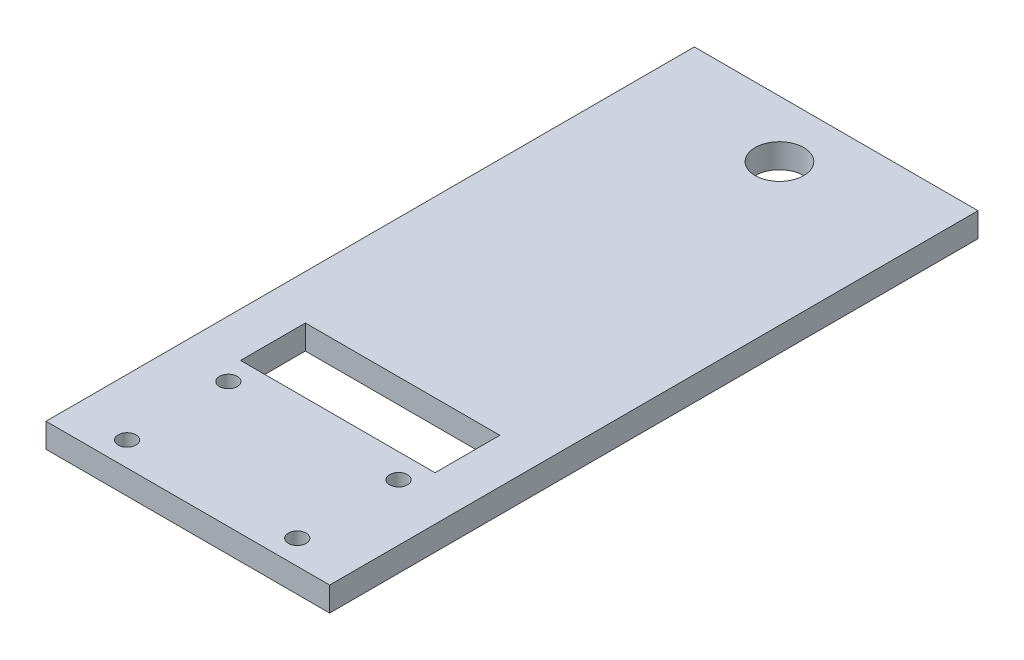
ISO-10303-21;
HEADER;
FILE_DESCRIPTION(('STEP AP214'),'2;1');
FILE_NAME('part.step','',(''),(''),'','','');
FILE_SCHEMA(('AUTOMOTIVE_DESIGN { 1 0 10303 214 1 1 1 1 }'));
ENDSEC;
DATA;
#1=APPLICATION_CONTEXT('core data for automotive mechanical design processes');
#2=APPLICATION_PROTOCOL_DEFINITION('international standard','automotive_design',2000,#1);
#3=PRODUCT_CONTEXT('',#1,'mechanical');
#4=PRODUCT('Part','Part','',(#3));
#5=PRODUCT_RELATED_PRODUCT_CATEGORY('part','',(#4));
#6=PRODUCT_DEFINITION_FORMATION('','',#4);
#7=PRODUCT_DEFINITION_CONTEXT('part definition',#1,'design');
#8=PRODUCT_DEFINITION('design','',#6,#7);
#9=PRODUCT_DEFINITION_SHAPE('','',#8);
#10=(LENGTH_UNIT() NAMED_UNIT(*) SI_UNIT(.MILLI.,.METRE.));
#11=(NAMED_UNIT(*) PLANE_ANGLE_UNIT() SI_UNIT($,.RADIAN.));
#12=(NAMED_UNIT(*) SI_UNIT($,.STERADIAN.) SOLID_ANGLE_UNIT());
#13=UNCERTAINTY_MEASURE_WITH_UNIT(LENGTH_MEASURE(1.E-05),#10,'distance_accuracy_value','');
#14=(GEOMETRIC_REPRESENTATION_CONTEXT(3) GLOBAL_UNCERTAINTY_ASSIGNED_CONTEXT((#13)) GLOBAL_UNIT_ASSIGNED_CONTEXT((#10,
#11,#12)) REPRESENTATION_CONTEXT('',''));
#15=CARTESIAN_POINT('',(0.,0.,0.));
#16=DIRECTION('',(0.,0.,1.));
#17=DIRECTION('',(1.,0.,0.));
#18=AXIS2_PLACEMENT_3D('',#15,#16,#17);
#19=CARTESIAN_POINT('',(0.,3.,0.));
#20=DIRECTION('',(0.,-1.,0.));
#21=DIRECTION('',(0.,0.,-1.));
#22=AXIS2_PLACEMENT_3D('',#19,#20,#21);
#23=PLANE('',#22);
#24=DIRECTION('',(-1.,0.,0.));
#25=VECTOR('',#24,1.);
#26=CARTESIAN_POINT('',(29.5,3.,-26.5));
#27=LINE('',#26,#25);
#28=CARTESIAN_POINT('',(29.5,3.,-26.5));
#29=VERTEX_POINT('',#28);
#30=CARTESIAN_POINT('',(5.5,3.,-26.5));
#31=VERTEX_POINT('',#30);
#32=EDGE_CURVE('E143',#29,#31,#27,.T.);
#33=ORIENTED_EDGE('',*,*,#32,.F.);
#34=DIRECTION('',(0.,0.,-1.));
#35=VECTOR('',#34,1.);
#36=CARTESIAN_POINT('',(29.5,3.,-18.5));
#37=LINE('',#36,#35);
#38=CARTESIAN_POINT('',(29.5,3.,-18.5));
#39=VERTEX_POINT('',#38);
#40=EDGE_CURVE('E59',#39,#29,#37,.T.);
#41=ORIENTED_EDGE('',*,*,#40,.F.);
#42=DIRECTION('',(1.,0.,0.));
#43=VECTOR('',#42,1.);
#44=CARTESIAN_POINT('',(29.5,3.,-18.5));
#45=LINE('',#44,#43);
#46=CARTESIAN_POINT('',(5.5,3.,-18.5));
#47=VERTEX_POINT('',#46);
#48=EDGE_CURVE('E130',#47,#39,#45,.T.);
#49=ORIENTED_EDGE('',*,*,#48,.F.);
#50=DIRECTION('',(0.,0.,1.));
#51=VECTOR('',#50,1.);
#52=CARTESIAN_POINT('',(5.5,3.,-18.5));
#53=LINE('',#52,#51);
#54=EDGE_CURVE('E134',#31,#47,#53,.T.);
#55=ORIENTED_EDGE('',*,*,#54,.F.);
#56=EDGE_LOOP('',(#33,#41,#49,#55));
#57=FACE_BOUND('',#56,.T.);
#58=CARTESIAN_POINT('',(17.5,3.,-73.));
#59=DIRECTION('',(0.,-1.,0.));
#60=DIRECTION('',(0.,0.,-1.));
#61=AXIS2_PLACEMENT_3D('',#58,#59,#60);
#62=CIRCLE('',#61,2.99999999999999);
#63=CARTESIAN_POINT('',(17.5,3.,-76.));
#64=VERTEX_POINT('',#63);
#65=EDGE_CURVE('E158',#64,#64,#62,.T.);
#66=ORIENTED_EDGE('',*,*,#65,.T.);
#67=EDGE_LOOP('',(#66));
#68=FACE_BOUND('',#67,.T.);
#69=DIRECTION('',(0.,0.,1.));
#70=VECTOR('',#69,1.);
#71=CARTESIAN_POINT('',(0.,3.,0.));
#72=LINE('',#71,#70);
#73=CARTESIAN_POINT('',(0.,3.,-80.));
#74=VERTEX_POINT('',#73);
#75=CARTESIAN_POINT('',(0.,3.,0.));
#76=VERTEX_POINT('',#75);
#77=EDGE_CURVE('E198',#74,#76,#72,.T.);
#78=ORIENTED_EDGE('',*,*,#77,.T.);
#79=DIRECTION('',(1.,0.,0.));
#80=VECTOR('',#79,1.);
#81=CARTESIAN_POINT('',(0.,3.,0.));
#82=LINE('',#81,#80);
#83=CARTESIAN_POINT('',(35.,3.,0.));
#84=VERTEX_POINT('',#83);
#85=EDGE_CURVE('E202',#76,#84,#82,.T.);
#86=ORIENTED_EDGE('',*,*,#85,.T.);
#87=DIRECTION('',(0.,0.,-1.));
#88=VECTOR('',#87,1.);
#89=CARTESIAN_POINT('',(35.,3.,0.));
#90=LINE('',#89,#88);
#91=CARTESIAN_POINT('',(35.,3.,-80.));
#92=VERTEX_POINT('',#91);
#93=EDGE_CURVE('E206',#84,#92,#90,.T.);
#94=ORIENTED_EDGE('',*,*,#93,.T.);
#95=DIRECTION('',(-1.,0.,0.));
#96=VECTOR('',#95,1.);
#97=CARTESIAN_POINT('',(0.,3.,-80.));
#98=LINE('',#97,#96);
#99=EDGE_CURVE('E209',#92,#74,#98,.T.);
#100=ORIENTED_EDGE('',*,*,#99,.T.);
#101=EDGE_LOOP('',(#78,#86,#94,#100));
#102=FACE_BOUND('',#101,.T.);
#103=CARTESIAN_POINT('',(7.,3.,-3.));
#104=DIRECTION('',(0.,1.,0.));
#105=DIRECTION('',(0.,0.,1.));
#106=AXIS2_PLACEMENT_3D('',#103,#104,#105);
#107=CIRCLE('',#106,1.1);
#108=CARTESIAN_POINT('',(7.,3.,-1.9));
#109=VERTEX_POINT('',#108);
#110=EDGE_CURVE('E190',#109,#109,#107,.T.);
#111=ORIENTED_EDGE('',*,*,#110,.F.);
#112=EDGE_LOOP('',(#111));
#113=FACE_BOUND('',#112,.T.);
#114=CARTESIAN_POINT('',(28.,3.,-3.));
#115=DIRECTION('',(0.,1.,0.));
#116=DIRECTION('',(0.,0.,1.));
#117=AXIS2_PLACEMENT_3D('',#114,#115,#116);
#118=CIRCLE('',#117,1.1);
#119=CARTESIAN_POINT('',(28.,3.,-1.9));
#120=VERTEX_POINT('',#119);
#121=EDGE_CURVE('E182',#120,#120,#118,.T.);
#122=ORIENTED_EDGE('',*,*,#121,.F.);
#123=EDGE_LOOP('',(#122));
#124=FACE_BOUND('',#123,.T.);
#125=CARTESIAN_POINT('',(7.,3.,-15.5));
#126=DIRECTION('',(0.,1.,0.));
#127=DIRECTION('',(0.,0.,1.));
#128=AXIS2_PLACEMENT_3D('',#125,#126,#127);
#129=CIRCLE('',#128,1.1);
#130=CARTESIAN_POINT('',(7.,3.,-14.4));
#131=VERTEX_POINT('',#130);
#132=EDGE_CURVE('E174',#131,#131,#129,.T.);
#133=ORIENTED_EDGE('',*,*,#132,.F.);
#134=EDGE_LOOP('',(#133));
#135=FACE_BOUND('',#134,.T.);
#136=CARTESIAN_POINT('',(28.,3.,-15.5));
#137=DIRECTION('',(0.,1.,0.));
#138=DIRECTION('',(0.,0.,1.));
#139=AXIS2_PLACEMENT_3D('',#136,#137,#138);
#140=CIRCLE('',#139,1.1);
#141=CARTESIAN_POINT('',(28.,3.,-14.4));
#142=VERTEX_POINT('',#141);
#143=EDGE_CURVE('E166',#142,#142,#140,.T.);
#144=ORIENTED_EDGE('',*,*,#143,.F.);
#145=EDGE_LOOP('',(#144));
#146=FACE_BOUND('',#145,.T.);
#147=ADVANCED_FACE('F43',(#57,#68,#102,#113,#124,#135,#146),#23,.F.);
#148=CARTESIAN_POINT('',(0.,0.,0.));
#149=DIRECTION('',(0.,-1.,0.));
#150=DIRECTION('',(0.,0.,-1.));
#151=AXIS2_PLACEMENT_3D('',#148,#149,#150);
#152=PLANE('',#151);
#153=DIRECTION('',(0.,0.,-1.));
#154=VECTOR('',#153,1.);
#155=CARTESIAN_POINT('',(29.5,0.,-18.5));
#156=LINE('',#155,#154);
#157=CARTESIAN_POINT('',(29.5,0.,-18.5));
#158=VERTEX_POINT('',#157);
#159=CARTESIAN_POINT('',(29.5,0.,-26.5));
#160=VERTEX_POINT('',#159);
#161=EDGE_CURVE('E111',#158,#160,#156,.T.);
#162=ORIENTED_EDGE('',*,*,#161,.T.);
#163=DIRECTION('',(-1.,0.,0.));
#164=VECTOR('',#163,1.);
#165=CARTESIAN_POINT('',(29.5,0.,-26.5));
#166=LINE('',#165,#164);
#167=CARTESIAN_POINT('',(5.5,0.,-26.5));
#168=VERTEX_POINT('',#167);
#169=EDGE_CURVE('E121',#160,#168,#166,.T.);
#170=ORIENTED_EDGE('',*,*,#169,.T.);
#171=DIRECTION('',(0.,0.,1.));
#172=VECTOR('',#171,1.);
#173=CARTESIAN_POINT('',(5.5,0.,-18.5));
#174=LINE('',#173,#172);
#175=CARTESIAN_POINT('',(5.5,0.,-18.5));
#176=VERTEX_POINT('',#175);
#177=EDGE_CURVE('E67',#168,#176,#174,.T.);
#178=ORIENTED_EDGE('',*,*,#177,.T.);
#179=DIRECTION('',(1.,0.,0.));
#180=VECTOR('',#179,1.);
#181=CARTESIAN_POINT('',(29.5,0.,-18.5));
#182=LINE('',#181,#180);
#183=EDGE_CURVE('E118',#176,#158,#182,.T.);
#184=ORIENTED_EDGE('',*,*,#183,.T.);
#185=EDGE_LOOP('',(#162,#170,#178,#184));
#186=FACE_BOUND('',#185,.T.);
#187=CARTESIAN_POINT('',(17.5,0.,-73.));
#188=DIRECTION('',(0.,-1.,0.));
#189=DIRECTION('',(0.,0.,-1.));
#190=AXIS2_PLACEMENT_3D('',#187,#188,#189);
#191=CIRCLE('',#190,2.99999999999999);
#192=CARTESIAN_POINT('',(17.5,0.,-76.));
#193=VERTEX_POINT('',#192);
#194=EDGE_CURVE('E152',#193,#193,#191,.T.);
#195=ORIENTED_EDGE('',*,*,#194,.F.);
#196=EDGE_LOOP('',(#195));
#197=FACE_BOUND('',#196,.T.);
#198=CARTESIAN_POINT('',(7.,0.,-15.5));
#199=DIRECTION('',(0.,1.,0.));
#200=DIRECTION('',(0.,0.,1.));
#201=AXIS2_PLACEMENT_3D('',#198,#199,#200);
#202=CIRCLE('',#201,1.1);
#203=CARTESIAN_POINT('',(7.,0.,-14.4));
#204=VERTEX_POINT('',#203);
#205=EDGE_CURVE('E170',#204,#204,#202,.T.);
#206=ORIENTED_EDGE('',*,*,#205,.T.);
#207=EDGE_LOOP('',(#206));
#208=FACE_BOUND('',#207,.T.);
#209=CARTESIAN_POINT('',(7.,0.,-3.));
#210=DIRECTION('',(0.,1.,0.));
#211=DIRECTION('',(0.,0.,1.));
#212=AXIS2_PLACEMENT_3D('',#209,#210,#211);
#213=CIRCLE('',#212,1.1);
#214=CARTESIAN_POINT('',(7.,0.,-1.9));
#215=VERTEX_POINT('',#214);
#216=EDGE_CURVE('E186',#215,#215,#213,.T.);
#217=ORIENTED_EDGE('',*,*,#216,.T.);
#218=EDGE_LOOP('',(#217));
#219=FACE_BOUND('',#218,.T.);
#220=DIRECTION('',(0.,0.,1.));
#221=VECTOR('',#220,1.);
#222=CARTESIAN_POINT('',(0.,0.,0.));
#223=LINE('',#222,#221);
#224=CARTESIAN_POINT('',(0.,0.,-80.));
#225=VERTEX_POINT('',#224);
#226=CARTESIAN_POINT('',(0.,0.,0.));
#227=VERTEX_POINT('',#226);
#228=EDGE_CURVE('E194',#225,#227,#223,.T.);
#229=ORIENTED_EDGE('',*,*,#228,.F.);
#230=DIRECTION('',(-1.,0.,0.));
#231=VECTOR('',#230,1.);
#232=CARTESIAN_POINT('',(0.,0.,-80.));
#233=LINE('',#232,#231);
#234=CARTESIAN_POINT('',(35.,0.,-80.));
#235=VERTEX_POINT('',#234);
#236=EDGE_CURVE('E203',#235,#225,#233,.T.);
#237=ORIENTED_EDGE('',*,*,#236,.F.);
#238=DIRECTION('',(0.,0.,-1.));
#239=VECTOR('',#238,1.);
#240=CARTESIAN_POINT('',(35.,0.,0.));
#241=LINE('',#240,#239);
#242=CARTESIAN_POINT('',(35.,0.,0.));
#243=VERTEX_POINT('',#242);
#244=EDGE_CURVE('E219',#243,#235,#241,.T.);
#245=ORIENTED_EDGE('',*,*,#244,.F.);
#246=DIRECTION('',(1.,0.,0.));
#247=VECTOR('',#246,1.);
#248=CARTESIAN_POINT('',(0.,0.,0.));
#249=LINE('',#248,#247);
#250=EDGE_CURVE('E216',#227,#243,#249,.T.);
#251=ORIENTED_EDGE('',*,*,#250,.F.);
#252=EDGE_LOOP('',(#229,#237,#245,#251));
#253=FACE_BOUND('',#252,.T.);
#254=CARTESIAN_POINT('',(28.,0.,-3.));
#255=DIRECTION('',(0.,1.,0.));
#256=DIRECTION('',(0.,0.,1.));
#257=AXIS2_PLACEMENT_3D('',#254,#255,#256);
#258=CIRCLE('',#257,1.1);
#259=CARTESIAN_POINT('',(28.,0.,-1.9));
#260=VERTEX_POINT('',#259);
#261=EDGE_CURVE('E178',#260,#260,#258,.T.);
#262=ORIENTED_EDGE('',*,*,#261,.T.);
#263=EDGE_LOOP('',(#262));
#264=FACE_BOUND('',#263,.T.);
#265=CARTESIAN_POINT('',(28.,0.,-15.5));
#266=DIRECTION('',(0.,1.,0.));
#267=DIRECTION('',(0.,0.,1.));
#268=AXIS2_PLACEMENT_3D('',#265,#266,#267);
#269=CIRCLE('',#268,1.1);
#270=CARTESIAN_POINT('',(28.,0.,-14.4));
#271=VERTEX_POINT('',#270);
#272=EDGE_CURVE('E162',#271,#271,#269,.T.);
#273=ORIENTED_EDGE('',*,*,#272,.T.);
#274=EDGE_LOOP('',(#273));
#275=FACE_BOUND('',#274,.T.);
#276=ADVANCED_FACE('F126',(#186,#197,#208,#219,#253,#264,#275),#152,.T.);
#277=CARTESIAN_POINT('',(0.,3.,0.));
#278=DIRECTION('',(1.,0.,0.));
#279=DIRECTION('',(0.,0.,-1.));
#280=AXIS2_PLACEMENT_3D('',#277,#278,#279);
#281=PLANE('',#280);
#282=ORIENTED_EDGE('',*,*,#228,.T.);
#283=DIRECTION('',(0.,-1.,0.));
#284=VECTOR('',#283,1.);
#285=CARTESIAN_POINT('',(0.,3.,0.));
#286=LINE('',#285,#284);
#287=EDGE_CURVE('E11',#76,#227,#286,.T.);
#288=ORIENTED_EDGE('',*,*,#287,.F.);
#289=ORIENTED_EDGE('',*,*,#77,.F.);
#290=DIRECTION('',(0.,-1.,0.));
#291=VECTOR('',#290,1.);
#292=CARTESIAN_POINT('',(0.,3.,-80.));
#293=LINE('',#292,#291);
#294=EDGE_CURVE('E212',#74,#225,#293,.T.);
#295=ORIENTED_EDGE('',*,*,#294,.T.);
#296=EDGE_LOOP('',(#282,#288,#289,#295));
#297=FACE_BOUND('',#296,.T.);
#298=ADVANCED_FACE('F45',(#297),#281,.F.);
#299=CARTESIAN_POINT('',(0.,3.,0.));
#300=DIRECTION('',(0.,0.,-1.));
#301=DIRECTION('',(-1.,0.,0.));
#302=AXIS2_PLACEMENT_3D('',#299,#300,#301);
#303=PLANE('',#302);
#304=ORIENTED_EDGE('',*,*,#250,.T.);
#305=DIRECTION('',(0.,-1.,0.));
#306=VECTOR('',#305,1.);
#307=CARTESIAN_POINT('',(35.,3.,0.));
#308=LINE('',#307,#306);
#309=EDGE_CURVE('E52',#84,#243,#308,.T.);
#310=ORIENTED_EDGE('',*,*,#309,.F.);
#311=ORIENTED_EDGE('',*,*,#85,.F.);
#312=ORIENTED_EDGE('',*,*,#287,.T.);
#313=EDGE_LOOP('',(#304,#310,#311,#312));
#314=FACE_BOUND('',#313,.T.);
#315=ADVANCED_FACE('F252',(#314),#303,.F.);
#316=CARTESIAN_POINT('',(35.,3.,0.));
#317=DIRECTION('',(-1.,0.,0.));
#318=DIRECTION('',(0.,0.,1.));
#319=AXIS2_PLACEMENT_3D('',#316,#317,#318);
#320=PLANE('',#319);
#321=ORIENTED_EDGE('',*,*,#244,.T.);
#322=DIRECTION('',(0.,-1.,0.));
#323=VECTOR('',#322,1.);
#324=CARTESIAN_POINT('',(35.,3.,-80.));
#325=LINE('',#324,#323);
#326=EDGE_CURVE('E227',#92,#235,#325,.T.);
#327=ORIENTED_EDGE('',*,*,#326,.F.);
#328=ORIENTED_EDGE('',*,*,#93,.F.);
#329=ORIENTED_EDGE('',*,*,#309,.T.);
#330=EDGE_LOOP('',(#321,#327,#328,#329));
#331=FACE_BOUND('',#330,.T.);
#332=ADVANCED_FACE('F236',(#331),#320,.F.);
#333=CARTESIAN_POINT('',(0.,3.,-80.));
#334=DIRECTION('',(0.,0.,1.));
#335=DIRECTION('',(1.,0.,0.));
#336=AXIS2_PLACEMENT_3D('',#333,#334,#335);
#337=PLANE('',#336);
#338=ORIENTED_EDGE('',*,*,#236,.T.);
#339=ORIENTED_EDGE('',*,*,#294,.F.);
#340=ORIENTED_EDGE('',*,*,#99,.F.);
#341=ORIENTED_EDGE('',*,*,#326,.T.);
#342=EDGE_LOOP('',(#338,#339,#340,#341));
#343=FACE_BOUND('',#342,.T.);
#344=ADVANCED_FACE('F245',(#343),#337,.F.);
#345=CARTESIAN_POINT('',(7.,3.,-3.));
#346=DIRECTION('',(0.,-1.,0.));
#347=DIRECTION('',(0.,0.,-1.));
#348=AXIS2_PLACEMENT_3D('',#345,#346,#347);
#349=CYLINDRICAL_SURFACE('',#348,1.1);
#350=ORIENTED_EDGE('',*,*,#110,.T.);
#351=EDGE_LOOP('',(#350));
#352=FACE_BOUND('',#351,.T.);
#353=ORIENTED_EDGE('',*,*,#216,.F.);
#354=EDGE_LOOP('',(#353));
#355=FACE_BOUND('',#354,.T.);
#356=ADVANCED_FACE('F268',(#352,#355),#349,.F.);
#357=CARTESIAN_POINT('',(28.,3.,-3.));
#358=DIRECTION('',(0.,-1.,0.));
#359=DIRECTION('',(0.,0.,-1.));
#360=AXIS2_PLACEMENT_3D('',#357,#358,#359);
#361=CYLINDRICAL_SURFACE('',#360,1.1);
#362=ORIENTED_EDGE('',*,*,#121,.T.);
#363=EDGE_LOOP('',(#362));
#364=FACE_BOUND('',#363,.T.);
#365=ORIENTED_EDGE('',*,*,#261,.F.);
#366=EDGE_LOOP('',(#365));
#367=FACE_BOUND('',#366,.T.);
#368=ADVANCED_FACE('F275',(#364,#367),#361,.F.);
#369=CARTESIAN_POINT('',(7.,3.,-15.5));
#370=DIRECTION('',(0.,-1.,0.));
#371=DIRECTION('',(0.,0.,-1.));
#372=AXIS2_PLACEMENT_3D('',#369,#370,#371);
#373=CYLINDRICAL_SURFACE('',#372,1.1);
#374=ORIENTED_EDGE('',*,*,#132,.T.);
#375=EDGE_LOOP('',(#374));
#376=FACE_BOUND('',#375,.T.);
#377=ORIENTED_EDGE('',*,*,#205,.F.);
#378=EDGE_LOOP('',(#377));
#379=FACE_BOUND('',#378,.T.);
#380=ADVANCED_FACE('F280',(#376,#379),#373,.F.);
#381=CARTESIAN_POINT('',(28.,3.,-15.5));
#382=DIRECTION('',(0.,-1.,0.));
#383=DIRECTION('',(0.,0.,-1.));
#384=AXIS2_PLACEMENT_3D('',#381,#382,#383);
#385=CYLINDRICAL_SURFACE('',#384,1.1);
#386=ORIENTED_EDGE('',*,*,#143,.T.);
#387=EDGE_LOOP('',(#386));
#388=FACE_BOUND('',#387,.T.);
#389=ORIENTED_EDGE('',*,*,#272,.F.);
#390=EDGE_LOOP('',(#389));
#391=FACE_BOUND('',#390,.T.);
#392=ADVANCED_FACE('F293',(#388,#391),#385,.F.);
#393=CARTESIAN_POINT('',(17.5,3.,-73.));
#394=DIRECTION('',(0.,-1.,0.));
#395=DIRECTION('',(0.,0.,-1.));
#396=AXIS2_PLACEMENT_3D('',#393,#394,#395);
#397=CYLINDRICAL_SURFACE('',#396,2.99999999999999);
#398=ORIENTED_EDGE('',*,*,#65,.F.);
#399=EDGE_LOOP('',(#398));
#400=FACE_BOUND('',#399,.T.);
#401=ORIENTED_EDGE('',*,*,#194,.T.);
#402=EDGE_LOOP('',(#401));
#403=FACE_BOUND('',#402,.T.);
#404=ADVANCED_FACE('F296',(#400,#403),#397,.F.);
#405=CARTESIAN_POINT('',(29.5,0.,-18.5));
#406=DIRECTION('',(1.,0.,0.));
#407=DIRECTION('',(0.,0.,-1.));
#408=AXIS2_PLACEMENT_3D('',#405,#406,#407);
#409=PLANE('',#408);
#410=ORIENTED_EDGE('',*,*,#40,.T.);
#411=DIRECTION('',(0.,1.,0.));
#412=VECTOR('',#411,1.);
#413=CARTESIAN_POINT('',(29.5,0.,-26.5));
#414=LINE('',#413,#412);
#415=EDGE_CURVE('E107',#160,#29,#414,.T.);
#416=ORIENTED_EDGE('',*,*,#415,.F.);
#417=ORIENTED_EDGE('',*,*,#161,.F.);
#418=DIRECTION('',(0.,1.,0.));
#419=VECTOR('',#418,1.);
#420=CARTESIAN_POINT('',(29.5,0.,-18.5));
#421=LINE('',#420,#419);
#422=EDGE_CURVE('E149',#158,#39,#421,.T.);
#423=ORIENTED_EDGE('',*,*,#422,.T.);
#424=EDGE_LOOP('',(#410,#416,#417,#423));
#425=FACE_BOUND('',#424,.T.);
#426=ADVANCED_FACE('F109',(#425),#409,.F.);
#427=CARTESIAN_POINT('',(29.5,0.,-18.5));
#428=DIRECTION('',(0.,0.,1.));
#429=DIRECTION('',(1.,0.,0.));
#430=AXIS2_PLACEMENT_3D('',#427,#428,#429);
#431=PLANE('',#430);
#432=ORIENTED_EDGE('',*,*,#48,.T.);
#433=ORIENTED_EDGE('',*,*,#422,.F.);
#434=ORIENTED_EDGE('',*,*,#183,.F.);
#435=DIRECTION('',(0.,1.,0.));
#436=VECTOR('',#435,1.);
#437=CARTESIAN_POINT('',(5.5,0.,-18.5));
#438=LINE('',#437,#436);
#439=EDGE_CURVE('E153',#176,#47,#438,.T.);
#440=ORIENTED_EDGE('',*,*,#439,.T.);
#441=EDGE_LOOP('',(#432,#433,#434,#440));
#442=FACE_BOUND('',#441,.T.);
#443=ADVANCED_FACE('F311',(#442),#431,.F.);
#444=CARTESIAN_POINT('',(5.5,0.,-18.5));
#445=DIRECTION('',(-1.,0.,0.));
#446=DIRECTION('',(0.,0.,1.));
#447=AXIS2_PLACEMENT_3D('',#444,#445,#446);
#448=PLANE('',#447);
#449=ORIENTED_EDGE('',*,*,#54,.T.);
#450=ORIENTED_EDGE('',*,*,#439,.F.);
#451=ORIENTED_EDGE('',*,*,#177,.F.);
#452=DIRECTION('',(0.,1.,0.));
#453=VECTOR('',#452,1.);
#454=CARTESIAN_POINT('',(5.5,0.,-26.5));
#455=LINE('',#454,#453);
#456=EDGE_CURVE('E117',#168,#31,#455,.T.);
#457=ORIENTED_EDGE('',*,*,#456,.T.);
#458=EDGE_LOOP('',(#449,#450,#451,#457));
#459=FACE_BOUND('',#458,.T.);
#460=ADVANCED_FACE('F314',(#459),#448,.F.);
#461=CARTESIAN_POINT('',(29.5,0.,-26.5));
#462=DIRECTION('',(0.,0.,-1.));
#463=DIRECTION('',(-1.,0.,0.));
#464=AXIS2_PLACEMENT_3D('',#461,#462,#463);
#465=PLANE('',#464);
#466=ORIENTED_EDGE('',*,*,#32,.T.);
#467=ORIENTED_EDGE('',*,*,#456,.F.);
#468=ORIENTED_EDGE('',*,*,#169,.F.);
#469=ORIENTED_EDGE('',*,*,#415,.T.);
#470=EDGE_LOOP('',(#466,#467,#468,#469));
#471=FACE_BOUND('',#470,.T.);
#472=ADVANCED_FACE('F122',(#471),#465,.F.);
#473=CLOSED_SHELL('',(#147,#276,#298,#315,#332,#344,#356,#368,#380,#392,#404,#426,#443,#460,#472));
#474=MANIFOLD_SOLID_BREP('B2',#473);
#475=ADVANCED_BREP_SHAPE_REPRESENTATION('',(#18,#474),#14);
#476=SHAPE_DEFINITION_REPRESENTATION(#9,#475);
ENDSEC;
END-ISO-10303-21;
